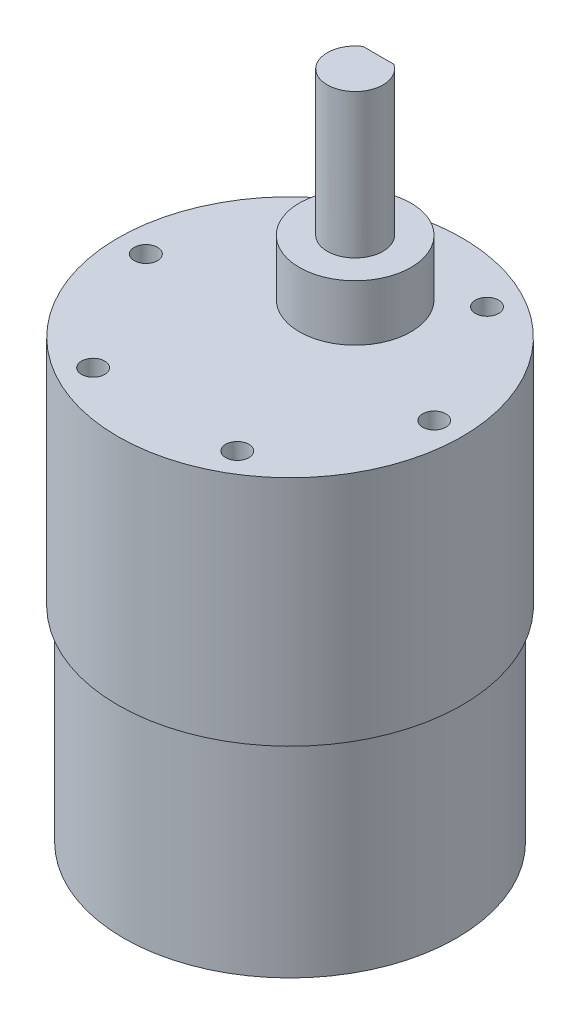
ISO-10303-21;
HEADER;
FILE_DESCRIPTION(('STEP AP214'),'2;1');
FILE_NAME('part.step','',(''),(''),'','','');
FILE_SCHEMA(('AUTOMOTIVE_DESIGN { 1 0 10303 214 1 1 1 1 }'));
ENDSEC;
DATA;
#1=APPLICATION_CONTEXT('core data for automotive mechanical design processes');
#2=APPLICATION_PROTOCOL_DEFINITION('international standard','automotive_design',2000,#1);
#3=PRODUCT_CONTEXT('',#1,'mechanical');
#4=PRODUCT('Part','Part','',(#3));
#5=PRODUCT_RELATED_PRODUCT_CATEGORY('part','',(#4));
#6=PRODUCT_DEFINITION_FORMATION('','',#4);
#7=PRODUCT_DEFINITION_CONTEXT('part definition',#1,'design');
#8=PRODUCT_DEFINITION('design','',#6,#7);
#9=PRODUCT_DEFINITION_SHAPE('','',#8);
#10=(LENGTH_UNIT() NAMED_UNIT(*) SI_UNIT(.MILLI.,.METRE.));
#11=(NAMED_UNIT(*) PLANE_ANGLE_UNIT() SI_UNIT($,.RADIAN.));
#12=(NAMED_UNIT(*) SI_UNIT($,.STERADIAN.) SOLID_ANGLE_UNIT());
#13=UNCERTAINTY_MEASURE_WITH_UNIT(LENGTH_MEASURE(1.E-05),#10,'distance_accuracy_value','');
#14=(GEOMETRIC_REPRESENTATION_CONTEXT(3) GLOBAL_UNCERTAINTY_ASSIGNED_CONTEXT((#13)) GLOBAL_UNIT_ASSIGNED_CONTEXT((#10,
#11,#12)) REPRESENTATION_CONTEXT('',''));
#15=CARTESIAN_POINT('',(0.,0.,0.));
#16=DIRECTION('',(0.,0.,1.));
#17=DIRECTION('',(1.,0.,0.));
#18=AXIS2_PLACEMENT_3D('',#15,#16,#17);
#19=CARTESIAN_POINT('',(0.,30.999999976,-6.99999997));
#20=DIRECTION('',(0.,1.,0.));
#21=DIRECTION('',(0.,0.,1.));
#22=AXIS2_PLACEMENT_3D('',#19,#20,#21);
#23=PLANE('',#22);
#24=CARTESIAN_POINT('',(0.,30.999999976,-6.99999997));
#25=DIRECTION('',(0.,1.,0.));
#26=DIRECTION('',(0.,0.,1.));
#27=AXIS2_PLACEMENT_3D('',#24,#25,#26);
#28=CIRCLE('',#27,5.999999938);
#29=CARTESIAN_POINT('',(0.,30.999999976,-1.000000032));
#30=VERTEX_POINT('',#29);
#31=EDGE_CURVE('E144',#30,#30,#28,.T.);
#32=ORIENTED_EDGE('',*,*,#31,.T.);
#33=EDGE_LOOP('',(#32));
#34=FACE_BOUND('',#33,.T.);
#35=CARTESIAN_POINT('',(0.,30.999999976,-6.99999997));
#36=DIRECTION('',(0.,1.,0.));
#37=DIRECTION('',(0.,0.,1.));
#38=AXIS2_PLACEMENT_3D('',#35,#36,#37);
#39=CIRCLE('',#38,2.999999969);
#40=CARTESIAN_POINT('',(0.,30.999999976,-4.000000001));
#41=VERTEX_POINT('',#40);
#42=EDGE_CURVE('E134',#41,#41,#39,.T.);
#43=ORIENTED_EDGE('',*,*,#42,.F.);
#44=EDGE_LOOP('',(#43));
#45=FACE_BOUND('',#44,.T.);
#46=ADVANCED_FACE('F34',(#34,#45),#23,.T.);
#47=CARTESIAN_POINT('',(0.,25.000000038,0.));
#48=DIRECTION('',(0.,-1.,0.));
#49=DIRECTION('',(0.,0.,-1.));
#50=AXIS2_PLACEMENT_3D('',#47,#48,#49);
#51=CYLINDRICAL_SURFACE('',#50,18.499999957);
#52=CARTESIAN_POINT('',(0.,25.000000038,0.));
#53=DIRECTION('',(0.,1.,0.));
#54=DIRECTION('',(0.,0.,1.));
#55=AXIS2_PLACEMENT_3D('',#52,#53,#54);
#56=CIRCLE('',#55,18.499999957);
#57=CARTESIAN_POINT('',(0.,25.000000038,18.499999957));
#58=VERTEX_POINT('',#57);
#59=EDGE_CURVE('E148',#58,#58,#56,.T.);
#60=ORIENTED_EDGE('',*,*,#59,.F.);
#61=EDGE_LOOP('',(#60));
#62=FACE_BOUND('',#61,.T.);
#63=CARTESIAN_POINT('',(0.,0.,0.));
#64=DIRECTION('',(0.,1.,0.));
#65=DIRECTION('',(0.,0.,1.));
#66=AXIS2_PLACEMENT_3D('',#63,#64,#65);
#67=CIRCLE('',#66,18.499999957);
#68=CARTESIAN_POINT('',(0.,0.,18.499999957));
#69=VERTEX_POINT('',#68);
#70=EDGE_CURVE('E38',#69,#69,#67,.T.);
#71=ORIENTED_EDGE('',*,*,#70,.T.);
#72=EDGE_LOOP('',(#71));
#73=FACE_BOUND('',#72,.T.);
#74=ADVANCED_FACE('F36',(#62,#73),#51,.T.);
#75=CARTESIAN_POINT('',(0.,25.000000038,0.));
#76=DIRECTION('',(0.,1.,0.));
#77=DIRECTION('',(0.,0.,1.));
#78=AXIS2_PLACEMENT_3D('',#75,#76,#77);
#79=PLANE('',#78);
#80=CARTESIAN_POINT('',(-15.499999988,25.000000038,0.));
#81=DIRECTION('',(0.,1.,0.));
#82=DIRECTION('',(0.,0.,1.));
#83=AXIS2_PLACEMENT_3D('',#80,#81,#82);
#84=CIRCLE('',#83,1.24999999999999);
#85=CARTESIAN_POINT('',(-15.499999988,25.000000038,1.24999999999999));
#86=VERTEX_POINT('',#85);
#87=EDGE_CURVE('E94',#86,#86,#84,.T.);
#88=ORIENTED_EDGE('',*,*,#87,.F.);
#89=EDGE_LOOP('',(#88));
#90=FACE_BOUND('',#89,.T.);
#91=CARTESIAN_POINT('',(-7.74999999399997,25.000000038,-13.4233937482665));
#92=DIRECTION('',(0.,1.,0.));
#93=DIRECTION('',(0.,0.,1.));
#94=AXIS2_PLACEMENT_3D('',#91,#92,#93);
#95=CIRCLE('',#94,1.24999999999999);
#96=CARTESIAN_POINT('',(-7.74999999399997,25.000000038,-12.1733937482665));
#97=VERTEX_POINT('',#96);
#98=EDGE_CURVE('E93',#97,#97,#95,.T.);
#99=ORIENTED_EDGE('',*,*,#98,.F.);
#100=EDGE_LOOP('',(#99));
#101=FACE_BOUND('',#100,.T.);
#102=CARTESIAN_POINT('',(7.74999999400006,25.000000038,-13.4233937482665));
#103=DIRECTION('',(0.,1.,0.));
#104=DIRECTION('',(0.,0.,1.));
#105=AXIS2_PLACEMENT_3D('',#102,#103,#104);
#106=CIRCLE('',#105,1.24999999999999);
#107=CARTESIAN_POINT('',(7.74999999400006,25.000000038,-12.1733937482665));
#108=VERTEX_POINT('',#107);
#109=EDGE_CURVE('E105',#108,#108,#106,.T.);
#110=ORIENTED_EDGE('',*,*,#109,.F.);
#111=EDGE_LOOP('',(#110));
#112=FACE_BOUND('',#111,.T.);
#113=CARTESIAN_POINT('',(15.499999988,25.000000038,1.08235921420342E-13));
#114=DIRECTION('',(0.,1.,0.));
#115=DIRECTION('',(0.,0.,1.));
#116=AXIS2_PLACEMENT_3D('',#113,#114,#115);
#117=CIRCLE('',#116,1.24999999999999);
#118=CARTESIAN_POINT('',(15.499999988,25.000000038,1.2500000000001));
#119=VERTEX_POINT('',#118);
#120=EDGE_CURVE('E111',#119,#119,#117,.T.);
#121=ORIENTED_EDGE('',*,*,#120,.F.);
#122=EDGE_LOOP('',(#121));
#123=FACE_BOUND('',#122,.T.);
#124=CARTESIAN_POINT('',(7.74999999399988,25.000000038,13.4233937482666));
#125=DIRECTION('',(0.,1.,0.));
#126=DIRECTION('',(0.,0.,1.));
#127=AXIS2_PLACEMENT_3D('',#124,#125,#126);
#128=CIRCLE('',#127,1.24999999999999);
#129=CARTESIAN_POINT('',(7.74999999399988,25.000000038,14.6733937482666));
#130=VERTEX_POINT('',#129);
#131=EDGE_CURVE('E117',#130,#130,#128,.T.);
#132=ORIENTED_EDGE('',*,*,#131,.F.);
#133=EDGE_LOOP('',(#132));
#134=FACE_BOUND('',#133,.T.);
#135=CARTESIAN_POINT('',(-7.74999999400016,25.000000038,13.4233937482664));
#136=DIRECTION('',(0.,1.,0.));
#137=DIRECTION('',(0.,0.,1.));
#138=AXIS2_PLACEMENT_3D('',#135,#136,#137);
#139=CIRCLE('',#138,1.24999999999999);
#140=CARTESIAN_POINT('',(-7.74999999400016,25.000000038,14.6733937482664));
#141=VERTEX_POINT('',#140);
#142=EDGE_CURVE('E123',#141,#141,#139,.T.);
#143=ORIENTED_EDGE('',*,*,#142,.F.);
#144=EDGE_LOOP('',(#143));
#145=FACE_BOUND('',#144,.T.);
#146=CARTESIAN_POINT('',(0.,25.000000038,-6.99999997));
#147=DIRECTION('',(0.,1.,0.));
#148=DIRECTION('',(0.,0.,1.));
#149=AXIS2_PLACEMENT_3D('',#146,#147,#148);
#150=CIRCLE('',#149,5.999999938);
#151=CARTESIAN_POINT('',(0.,25.000000038,-1.000000032));
#152=VERTEX_POINT('',#151);
#153=EDGE_CURVE('E43',#152,#152,#150,.T.);
#154=ORIENTED_EDGE('',*,*,#153,.F.);
#155=EDGE_LOOP('',(#154));
#156=FACE_BOUND('',#155,.T.);
#157=ORIENTED_EDGE('',*,*,#59,.T.);
#158=EDGE_LOOP('',(#157));
#159=FACE_BOUND('',#158,.T.);
#160=ADVANCED_FACE('F159',(#90,#101,#112,#123,#134,#145,#156,#159),#79,.T.);
#161=CARTESIAN_POINT('',(0.,0.,0.));
#162=DIRECTION('',(0.,1.,0.));
#163=DIRECTION('',(0.,0.,1.));
#164=AXIS2_PLACEMENT_3D('',#161,#162,#163);
#165=PLANE('',#164);
#166=CARTESIAN_POINT('',(0.,0.,0.));
#167=DIRECTION('',(0.,-1.,0.));
#168=DIRECTION('',(0.,0.,-1.));
#169=AXIS2_PLACEMENT_3D('',#166,#167,#168);
#170=CIRCLE('',#169,17.900000014);
#171=CARTESIAN_POINT('',(0.,0.,-17.900000014));
#172=VERTEX_POINT('',#171);
#173=EDGE_CURVE('E11',#172,#172,#170,.T.);
#174=ORIENTED_EDGE('',*,*,#173,.F.);
#175=EDGE_LOOP('',(#174));
#176=FACE_BOUND('',#175,.T.);
#177=ORIENTED_EDGE('',*,*,#70,.F.);
#178=EDGE_LOOP('',(#177));
#179=FACE_BOUND('',#178,.T.);
#180=ADVANCED_FACE('F156',(#176,#179),#165,.F.);
#181=CARTESIAN_POINT('',(0.,30.999999976,-6.99999997));
#182=DIRECTION('',(0.,-1.,0.));
#183=DIRECTION('',(0.,0.,-1.));
#184=AXIS2_PLACEMENT_3D('',#181,#182,#183);
#185=CYLINDRICAL_SURFACE('',#184,5.999999938);
#186=ORIENTED_EDGE('',*,*,#31,.F.);
#187=EDGE_LOOP('',(#186));
#188=FACE_BOUND('',#187,.T.);
#189=ORIENTED_EDGE('',*,*,#153,.T.);
#190=EDGE_LOOP('',(#189));
#191=FACE_BOUND('',#190,.T.);
#192=ADVANCED_FACE('F158',(#188,#191),#185,.T.);
#193=CARTESIAN_POINT('',(0.,46.499999964,-9.50000005));
#194=DIRECTION('',(0.,0.,-1.));
#195=DIRECTION('',(-1.,0.,0.));
#196=AXIS2_PLACEMENT_3D('',#193,#194,#195);
#197=PLANE('',#196);
#198=DIRECTION('',(1.,0.,0.));
#199=VECTOR('',#198,1.);
#200=CARTESIAN_POINT('',(0.,36.999999914,-9.50000005));
#201=LINE('',#200,#199);
#202=CARTESIAN_POINT('',(-1.65831221849204,36.999999914,-9.50000005));
#203=VERTEX_POINT('',#202);
#204=CARTESIAN_POINT('',(1.65831221849204,36.999999914,-9.50000005));
#205=VERTEX_POINT('',#204);
#206=EDGE_CURVE('E129',#203,#205,#201,.T.);
#207=ORIENTED_EDGE('',*,*,#206,.F.);
#208=DIRECTION('',(0.,-1.,0.));
#209=VECTOR('',#208,1.);
#210=CARTESIAN_POINT('',(-1.65831221849204,46.499999964,-9.50000005));
#211=LINE('',#210,#209);
#212=CARTESIAN_POINT('',(-1.65831221849204,46.499999964,-9.50000005));
#213=VERTEX_POINT('',#212);
#214=EDGE_CURVE('E58',#213,#203,#211,.T.);
#215=ORIENTED_EDGE('',*,*,#214,.F.);
#216=DIRECTION('',(1.,0.,0.));
#217=VECTOR('',#216,1.);
#218=CARTESIAN_POINT('',(0.,46.499999964,-9.50000005));
#219=LINE('',#218,#217);
#220=CARTESIAN_POINT('',(1.65831221849204,46.499999964,-9.50000005));
#221=VERTEX_POINT('',#220);
#222=EDGE_CURVE('E135',#213,#221,#219,.T.);
#223=ORIENTED_EDGE('',*,*,#222,.T.);
#224=DIRECTION('',(0.,-1.,0.));
#225=VECTOR('',#224,1.);
#226=CARTESIAN_POINT('',(1.65831221849204,46.499999964,-9.50000005));
#227=LINE('',#226,#225);
#228=EDGE_CURVE('E138',#221,#205,#227,.T.);
#229=ORIENTED_EDGE('',*,*,#228,.T.);
#230=EDGE_LOOP('',(#207,#215,#223,#229));
#231=FACE_BOUND('',#230,.T.);
#232=ADVANCED_FACE('F165',(#231),#197,.T.);
#233=CARTESIAN_POINT('',(0.,46.499999964,-6.99999997));
#234=DIRECTION('',(0.,-1.,0.));
#235=DIRECTION('',(0.,0.,-1.));
#236=AXIS2_PLACEMENT_3D('',#233,#234,#235);
#237=CYLINDRICAL_SURFACE('',#236,2.999999969);
#238=ORIENTED_EDGE('',*,*,#42,.T.);
#239=EDGE_LOOP('',(#238));
#240=FACE_BOUND('',#239,.T.);
#241=CARTESIAN_POINT('',(0.,36.999999914,-6.99999997));
#242=DIRECTION('',(0.,1.,0.));
#243=DIRECTION('',(0.,0.,1.));
#244=AXIS2_PLACEMENT_3D('',#241,#242,#243);
#245=CIRCLE('',#244,2.999999969);
#246=EDGE_CURVE('E132',#205,#203,#245,.T.);
#247=ORIENTED_EDGE('',*,*,#246,.F.);
#248=ORIENTED_EDGE('',*,*,#228,.F.);
#249=CARTESIAN_POINT('',(0.,46.499999964,-6.99999997));
#250=DIRECTION('',(0.,1.,0.));
#251=DIRECTION('',(0.,0.,1.));
#252=AXIS2_PLACEMENT_3D('',#249,#250,#251);
#253=CIRCLE('',#252,2.999999969);
#254=EDGE_CURVE('E50',#213,#221,#253,.T.);
#255=ORIENTED_EDGE('',*,*,#254,.F.);
#256=ORIENTED_EDGE('',*,*,#214,.T.);
#257=EDGE_LOOP('',(#247,#248,#255,#256));
#258=FACE_BOUND('',#257,.T.);
#259=ADVANCED_FACE('F182',(#240,#258),#237,.T.);
#260=CARTESIAN_POINT('',(0.,46.499999964,0.));
#261=DIRECTION('',(0.,1.,0.));
#262=DIRECTION('',(0.,0.,1.));
#263=AXIS2_PLACEMENT_3D('',#260,#261,#262);
#264=PLANE('',#263);
#265=ORIENTED_EDGE('',*,*,#222,.F.);
#266=ORIENTED_EDGE('',*,*,#254,.T.);
#267=EDGE_LOOP('',(#265,#266));
#268=FACE_BOUND('',#267,.T.);
#269=ADVANCED_FACE('F185',(#268),#264,.T.);
#270=CARTESIAN_POINT('',(0.,36.999999914,0.));
#271=DIRECTION('',(0.,1.,0.));
#272=DIRECTION('',(0.,0.,1.));
#273=AXIS2_PLACEMENT_3D('',#270,#271,#272);
#274=PLANE('',#273);
#275=ORIENTED_EDGE('',*,*,#206,.T.);
#276=ORIENTED_EDGE('',*,*,#246,.T.);
#277=EDGE_LOOP('',(#275,#276));
#278=FACE_BOUND('',#277,.T.);
#279=ADVANCED_FACE('F189',(#278),#274,.T.);
#280=CARTESIAN_POINT('',(-7.74999999400016,21.500007038,13.4233937482664));
#281=DIRECTION('',(0.,1.,0.));
#282=DIRECTION('',(0.,0.,1.));
#283=AXIS2_PLACEMENT_3D('',#280,#281,#282);
#284=CONICAL_SURFACE('',#283,1.25,1.02974425867665);
#285=CARTESIAN_POINT('',(-7.74999999400016,20.7489312642155,13.4233937482664));
#286=VERTEX_POINT('',#285);
#287=VERTEX_LOOP('',#286);
#288=FACE_BOUND('',#287,.T.);
#289=CARTESIAN_POINT('',(-7.74999999400016,21.500007038,13.4233937482664));
#290=DIRECTION('',(0.,1.,0.));
#291=DIRECTION('',(0.,0.,1.));
#292=AXIS2_PLACEMENT_3D('',#289,#290,#291);
#293=CIRCLE('',#292,1.25);
#294=CARTESIAN_POINT('',(-7.74999999400016,21.500007038,14.6733937482664));
#295=VERTEX_POINT('',#294);
#296=EDGE_CURVE('E126',#295,#295,#293,.T.);
#297=ORIENTED_EDGE('',*,*,#296,.T.);
#298=EDGE_LOOP('',(#297));
#299=FACE_BOUND('',#298,.T.);
#300=ADVANCED_FACE('F192',(#288,#299),#284,.F.);
#301=CARTESIAN_POINT('',(-7.74999999400016,25.000000038,13.4233937482664));
#302=DIRECTION('',(0.,1.,0.));
#303=DIRECTION('',(0.,0.,1.));
#304=AXIS2_PLACEMENT_3D('',#301,#302,#303);
#305=CYLINDRICAL_SURFACE('',#304,1.24999999999999);
#306=ORIENTED_EDGE('',*,*,#296,.F.);
#307=EDGE_LOOP('',(#306));
#308=FACE_BOUND('',#307,.T.);
#309=ORIENTED_EDGE('',*,*,#142,.T.);
#310=EDGE_LOOP('',(#309));
#311=FACE_BOUND('',#310,.T.);
#312=ADVANCED_FACE('F196',(#308,#311),#305,.F.);
#313=CARTESIAN_POINT('',(7.74999999399988,21.500007038,13.4233937482666));
#314=DIRECTION('',(0.,1.,0.));
#315=DIRECTION('',(0.,0.,1.));
#316=AXIS2_PLACEMENT_3D('',#313,#314,#315);
#317=CONICAL_SURFACE('',#316,1.25,1.02974425867665);
#318=CARTESIAN_POINT('',(7.74999999399988,20.7489312642155,13.4233937482666));
#319=VERTEX_POINT('',#318);
#320=VERTEX_LOOP('',#319);
#321=FACE_BOUND('',#320,.T.);
#322=CARTESIAN_POINT('',(7.74999999399988,21.500007038,13.4233937482666));
#323=DIRECTION('',(0.,1.,0.));
#324=DIRECTION('',(0.,0.,1.));
#325=AXIS2_PLACEMENT_3D('',#322,#323,#324);
#326=CIRCLE('',#325,1.25);
#327=CARTESIAN_POINT('',(7.74999999399988,21.500007038,14.6733937482666));
#328=VERTEX_POINT('',#327);
#329=EDGE_CURVE('E120',#328,#328,#326,.T.);
#330=ORIENTED_EDGE('',*,*,#329,.T.);
#331=EDGE_LOOP('',(#330));
#332=FACE_BOUND('',#331,.T.);
#333=ADVANCED_FACE('F200',(#321,#332),#317,.F.);
#334=CARTESIAN_POINT('',(7.74999999399988,25.000000038,13.4233937482666));
#335=DIRECTION('',(0.,1.,0.));
#336=DIRECTION('',(0.,0.,1.));
#337=AXIS2_PLACEMENT_3D('',#334,#335,#336);
#338=CYLINDRICAL_SURFACE('',#337,1.24999999999999);
#339=ORIENTED_EDGE('',*,*,#329,.F.);
#340=EDGE_LOOP('',(#339));
#341=FACE_BOUND('',#340,.T.);
#342=ORIENTED_EDGE('',*,*,#131,.T.);
#343=EDGE_LOOP('',(#342));
#344=FACE_BOUND('',#343,.T.);
#345=ADVANCED_FACE('F204',(#341,#344),#338,.F.);
#346=CARTESIAN_POINT('',(15.499999988,21.500007038,1.08235921420342E-13));
#347=DIRECTION('',(0.,1.,0.));
#348=DIRECTION('',(0.,0.,1.));
#349=AXIS2_PLACEMENT_3D('',#346,#347,#348);
#350=CONICAL_SURFACE('',#349,1.25,1.02974425867665);
#351=CARTESIAN_POINT('',(15.499999988,20.7489312642155,1.08235921420342E-13));
#352=VERTEX_POINT('',#351);
#353=VERTEX_LOOP('',#352);
#354=FACE_BOUND('',#353,.T.);
#355=CARTESIAN_POINT('',(15.499999988,21.500007038,1.08235921420342E-13));
#356=DIRECTION('',(0.,1.,0.));
#357=DIRECTION('',(0.,0.,1.));
#358=AXIS2_PLACEMENT_3D('',#355,#356,#357);
#359=CIRCLE('',#358,1.25);
#360=CARTESIAN_POINT('',(15.499999988,21.500007038,1.25000000000011));
#361=VERTEX_POINT('',#360);
#362=EDGE_CURVE('E114',#361,#361,#359,.T.);
#363=ORIENTED_EDGE('',*,*,#362,.T.);
#364=EDGE_LOOP('',(#363));
#365=FACE_BOUND('',#364,.T.);
#366=ADVANCED_FACE('F208',(#354,#365),#350,.F.);
#367=CARTESIAN_POINT('',(15.499999988,25.000000038,1.08235921420342E-13));
#368=DIRECTION('',(0.,1.,0.));
#369=DIRECTION('',(0.,0.,1.));
#370=AXIS2_PLACEMENT_3D('',#367,#368,#369);
#371=CYLINDRICAL_SURFACE('',#370,1.24999999999999);
#372=ORIENTED_EDGE('',*,*,#362,.F.);
#373=EDGE_LOOP('',(#372));
#374=FACE_BOUND('',#373,.T.);
#375=ORIENTED_EDGE('',*,*,#120,.T.);
#376=EDGE_LOOP('',(#375));
#377=FACE_BOUND('',#376,.T.);
#378=ADVANCED_FACE('F212',(#374,#377),#371,.F.);
#379=CARTESIAN_POINT('',(7.74999999400006,21.500007038,-13.4233937482665));
#380=DIRECTION('',(0.,1.,0.));
#381=DIRECTION('',(0.,0.,1.));
#382=AXIS2_PLACEMENT_3D('',#379,#380,#381);
#383=CONICAL_SURFACE('',#382,1.25,1.02974425867665);
#384=CARTESIAN_POINT('',(7.74999999400006,20.7489312642155,-13.4233937482665));
#385=VERTEX_POINT('',#384);
#386=VERTEX_LOOP('',#385);
#387=FACE_BOUND('',#386,.T.);
#388=CARTESIAN_POINT('',(7.74999999400006,21.500007038,-13.4233937482665));
#389=DIRECTION('',(0.,1.,0.));
#390=DIRECTION('',(0.,0.,1.));
#391=AXIS2_PLACEMENT_3D('',#388,#389,#390);
#392=CIRCLE('',#391,1.25);
#393=CARTESIAN_POINT('',(7.74999999400006,21.500007038,-12.1733937482665));
#394=VERTEX_POINT('',#393);
#395=EDGE_CURVE('E108',#394,#394,#392,.T.);
#396=ORIENTED_EDGE('',*,*,#395,.T.);
#397=EDGE_LOOP('',(#396));
#398=FACE_BOUND('',#397,.T.);
#399=ADVANCED_FACE('F216',(#387,#398),#383,.F.);
#400=CARTESIAN_POINT('',(7.74999999400006,25.000000038,-13.4233937482665));
#401=DIRECTION('',(0.,1.,0.));
#402=DIRECTION('',(0.,0.,1.));
#403=AXIS2_PLACEMENT_3D('',#400,#401,#402);
#404=CYLINDRICAL_SURFACE('',#403,1.24999999999999);
#405=ORIENTED_EDGE('',*,*,#395,.F.);
#406=EDGE_LOOP('',(#405));
#407=FACE_BOUND('',#406,.T.);
#408=ORIENTED_EDGE('',*,*,#109,.T.);
#409=EDGE_LOOP('',(#408));
#410=FACE_BOUND('',#409,.T.);
#411=ADVANCED_FACE('F220',(#407,#410),#404,.F.);
#412=CARTESIAN_POINT('',(-7.74999999399997,21.500007038,-13.4233937482665));
#413=DIRECTION('',(0.,1.,0.));
#414=DIRECTION('',(0.,0.,1.));
#415=AXIS2_PLACEMENT_3D('',#412,#413,#414);
#416=CONICAL_SURFACE('',#415,1.25,1.02974425867665);
#417=CARTESIAN_POINT('',(-7.74999999399997,20.7489312642155,-13.4233937482665));
#418=VERTEX_POINT('',#417);
#419=VERTEX_LOOP('',#418);
#420=FACE_BOUND('',#419,.T.);
#421=CARTESIAN_POINT('',(-7.74999999399997,21.500007038,-13.4233937482665));
#422=DIRECTION('',(0.,1.,0.));
#423=DIRECTION('',(0.,0.,1.));
#424=AXIS2_PLACEMENT_3D('',#421,#422,#423);
#425=CIRCLE('',#424,1.25);
#426=CARTESIAN_POINT('',(-7.74999999399997,21.500007038,-12.1733937482665));
#427=VERTEX_POINT('',#426);
#428=EDGE_CURVE('E97',#427,#427,#425,.T.);
#429=ORIENTED_EDGE('',*,*,#428,.T.);
#430=EDGE_LOOP('',(#429));
#431=FACE_BOUND('',#430,.T.);
#432=ADVANCED_FACE('F224',(#420,#431),#416,.F.);
#433=CARTESIAN_POINT('',(-7.74999999399997,25.000000038,-13.4233937482665));
#434=DIRECTION('',(0.,1.,0.));
#435=DIRECTION('',(0.,0.,1.));
#436=AXIS2_PLACEMENT_3D('',#433,#434,#435);
#437=CYLINDRICAL_SURFACE('',#436,1.24999999999999);
#438=ORIENTED_EDGE('',*,*,#428,.F.);
#439=EDGE_LOOP('',(#438));
#440=FACE_BOUND('',#439,.T.);
#441=ORIENTED_EDGE('',*,*,#98,.T.);
#442=EDGE_LOOP('',(#441));
#443=FACE_BOUND('',#442,.T.);
#444=ADVANCED_FACE('F87',(#440,#443),#437,.F.);
#445=CARTESIAN_POINT('',(-15.499999988,21.500007038,0.));
#446=DIRECTION('',(0.,1.,0.));
#447=DIRECTION('',(0.,0.,1.));
#448=AXIS2_PLACEMENT_3D('',#445,#446,#447);
#449=CONICAL_SURFACE('',#448,1.25,1.02974425867665);
#450=CARTESIAN_POINT('',(-15.499999988,20.7489312642155,0.));
#451=VERTEX_POINT('',#450);
#452=VERTEX_LOOP('',#451);
#453=FACE_BOUND('',#452,.T.);
#454=CARTESIAN_POINT('',(-15.499999988,21.500007038,0.));
#455=DIRECTION('',(0.,1.,0.));
#456=DIRECTION('',(0.,0.,1.));
#457=AXIS2_PLACEMENT_3D('',#454,#455,#456);
#458=CIRCLE('',#457,1.25);
#459=CARTESIAN_POINT('',(-15.499999988,21.500007038,1.25));
#460=VERTEX_POINT('',#459);
#461=EDGE_CURVE('E91',#460,#460,#458,.T.);
#462=ORIENTED_EDGE('',*,*,#461,.T.);
#463=EDGE_LOOP('',(#462));
#464=FACE_BOUND('',#463,.T.);
#465=ADVANCED_FACE('F83',(#453,#464),#449,.F.);
#466=CARTESIAN_POINT('',(-15.499999988,25.000000038,0.));
#467=DIRECTION('',(0.,1.,0.));
#468=DIRECTION('',(0.,0.,1.));
#469=AXIS2_PLACEMENT_3D('',#466,#467,#468);
#470=CYLINDRICAL_SURFACE('',#469,1.24999999999999);
#471=ORIENTED_EDGE('',*,*,#461,.F.);
#472=EDGE_LOOP('',(#471));
#473=FACE_BOUND('',#472,.T.);
#474=ORIENTED_EDGE('',*,*,#87,.T.);
#475=EDGE_LOOP('',(#474));
#476=FACE_BOUND('',#475,.T.);
#477=ADVANCED_FACE('F86',(#473,#476),#470,.F.);
#478=CARTESIAN_POINT('',(0.,-21.999999942,0.));
#479=DIRECTION('',(0.,1.,0.));
#480=DIRECTION('',(0.,0.,1.));
#481=AXIS2_PLACEMENT_3D('',#478,#479,#480);
#482=CYLINDRICAL_SURFACE('',#481,17.900000014);
#483=CARTESIAN_POINT('',(0.,-21.999999942,0.));
#484=DIRECTION('',(0.,-1.,0.));
#485=DIRECTION('',(0.,0.,-1.));
#486=AXIS2_PLACEMENT_3D('',#483,#484,#485);
#487=CIRCLE('',#486,17.900000014);
#488=CARTESIAN_POINT('',(0.,-21.999999942,-17.900000014));
#489=VERTEX_POINT('',#488);
#490=EDGE_CURVE('E100',#489,#489,#487,.T.);
#491=ORIENTED_EDGE('',*,*,#490,.F.);
#492=EDGE_LOOP('',(#491));
#493=FACE_BOUND('',#492,.T.);
#494=ORIENTED_EDGE('',*,*,#173,.T.);
#495=EDGE_LOOP('',(#494));
#496=FACE_BOUND('',#495,.T.);
#497=ADVANCED_FACE('F234',(#493,#496),#482,.T.);
#498=CARTESIAN_POINT('',(0.,-21.999999942,0.));
#499=DIRECTION('',(0.,-1.,0.));
#500=DIRECTION('',(0.,0.,-1.));
#501=AXIS2_PLACEMENT_3D('',#498,#499,#500);
#502=PLANE('',#501);
#503=ORIENTED_EDGE('',*,*,#490,.T.);
#504=EDGE_LOOP('',(#503));
#505=FACE_BOUND('',#504,.T.);
#506=ADVANCED_FACE('F237',(#505),#502,.T.);
#507=CLOSED_SHELL('',(#46,#74,#160,#180,#192,#232,#259,#269,#279,#300,#312,#333,#345,#366,#378,
#399,#411,#432,#444,#465,#477,#497,#506));
#508=MANIFOLD_SOLID_BREP('B2',#507);
#509=ADVANCED_BREP_SHAPE_REPRESENTATION('',(#18,#508),#14);
#510=SHAPE_DEFINITION_REPRESENTATION(#9,#509);
ENDSEC;
END-ISO-10303-21;
